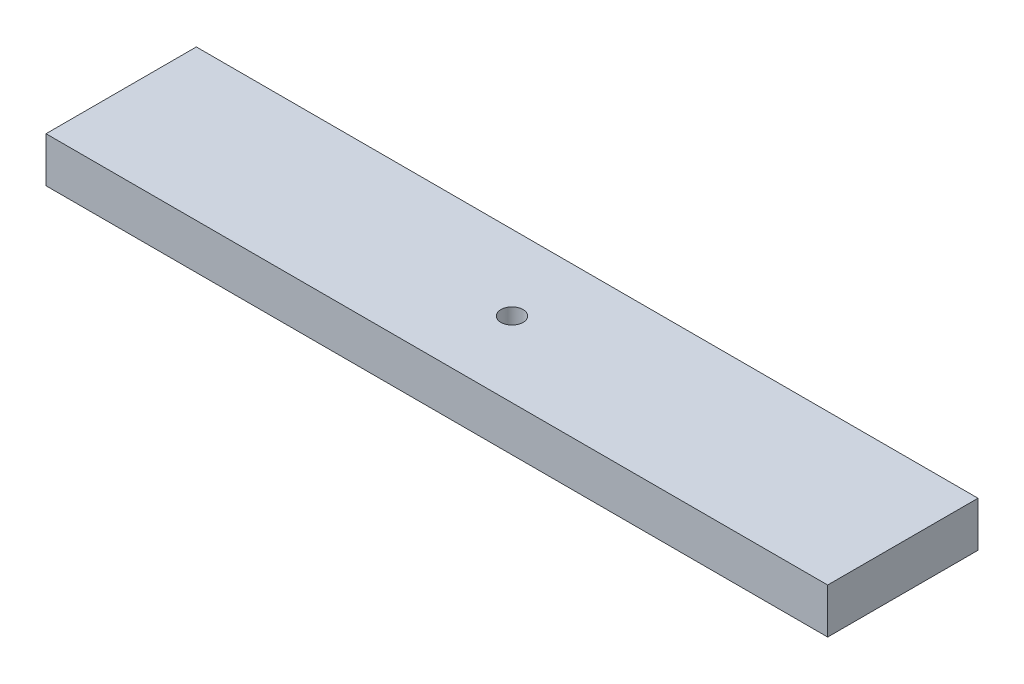
ISO-10303-21;
HEADER;
FILE_DESCRIPTION(('STEP AP214'),'2;1');
FILE_NAME('part.step','',(''),(''),'','','');
FILE_SCHEMA(('AUTOMOTIVE_DESIGN { 1 0 10303 214 1 1 1 1 }'));
ENDSEC;
DATA;
#1=APPLICATION_CONTEXT('core data for automotive mechanical design processes');
#2=APPLICATION_PROTOCOL_DEFINITION('international standard','automotive_design',2000,#1);
#3=PRODUCT_CONTEXT('',#1,'mechanical');
#4=PRODUCT('Part','Part','',(#3));
#5=PRODUCT_RELATED_PRODUCT_CATEGORY('part','',(#4));
#6=PRODUCT_DEFINITION_FORMATION('','',#4);
#7=PRODUCT_DEFINITION_CONTEXT('part definition',#1,'design');
#8=PRODUCT_DEFINITION('design','',#6,#7);
#9=PRODUCT_DEFINITION_SHAPE('','',#8);
#10=(LENGTH_UNIT() NAMED_UNIT(*) SI_UNIT(.MILLI.,.METRE.));
#11=(NAMED_UNIT(*) PLANE_ANGLE_UNIT() SI_UNIT($,.RADIAN.));
#12=(NAMED_UNIT(*) SI_UNIT($,.STERADIAN.) SOLID_ANGLE_UNIT());
#13=UNCERTAINTY_MEASURE_WITH_UNIT(LENGTH_MEASURE(1.E-05),#10,'distance_accuracy_value','');
#14=(GEOMETRIC_REPRESENTATION_CONTEXT(3) GLOBAL_UNCERTAINTY_ASSIGNED_CONTEXT((#13)) GLOBAL_UNIT_ASSIGNED_CONTEXT((#10,
#11,#12)) REPRESENTATION_CONTEXT('',''));
#15=CARTESIAN_POINT('',(0.,0.,0.));
#16=DIRECTION('',(0.,0.,1.));
#17=DIRECTION('',(1.,0.,0.));
#18=AXIS2_PLACEMENT_3D('',#15,#16,#17);
#19=CARTESIAN_POINT('',(-165.1,0.,63.5));
#20=DIRECTION('',(0.,1.,0.));
#21=DIRECTION('',(0.,0.,1.));
#22=AXIS2_PLACEMENT_3D('',#19,#20,#21);
#23=PLANE('',#22);
#24=DIRECTION('',(1.,0.,0.));
#25=VECTOR('',#24,1.);
#26=CARTESIAN_POINT('',(-165.1,0.,0.));
#27=LINE('',#26,#25);
#28=CARTESIAN_POINT('',(-165.1,0.,0.));
#29=VERTEX_POINT('',#28);
#30=CARTESIAN_POINT('',(165.1,0.,0.));
#31=VERTEX_POINT('',#30);
#32=EDGE_CURVE('E89',#29,#31,#27,.T.);
#33=ORIENTED_EDGE('',*,*,#32,.T.);
#34=DIRECTION('',(0.,0.,-1.));
#35=VECTOR('',#34,1.);
#36=CARTESIAN_POINT('',(165.1,0.,63.5));
#37=LINE('',#36,#35);
#38=CARTESIAN_POINT('',(165.1,0.,63.5));
#39=VERTEX_POINT('',#38);
#40=EDGE_CURVE('E42',#39,#31,#37,.T.);
#41=ORIENTED_EDGE('',*,*,#40,.F.);
#42=DIRECTION('',(1.,0.,0.));
#43=VECTOR('',#42,1.);
#44=CARTESIAN_POINT('',(-165.1,0.,63.5));
#45=LINE('',#44,#43);
#46=CARTESIAN_POINT('',(-165.1,0.,63.5));
#47=VERTEX_POINT('',#46);
#48=EDGE_CURVE('E80',#47,#39,#45,.T.);
#49=ORIENTED_EDGE('',*,*,#48,.F.);
#50=DIRECTION('',(0.,0.,-1.));
#51=VECTOR('',#50,1.);
#52=CARTESIAN_POINT('',(-165.1,0.,63.5));
#53=LINE('',#52,#51);
#54=EDGE_CURVE('E11',#47,#29,#53,.T.);
#55=ORIENTED_EDGE('',*,*,#54,.T.);
#56=EDGE_LOOP('',(#33,#41,#49,#55));
#57=FACE_BOUND('',#56,.T.);
#58=CARTESIAN_POINT('',(0.,0.,31.75));
#59=DIRECTION('',(0.,1.,0.));
#60=DIRECTION('',(0.,0.,1.));
#61=AXIS2_PLACEMENT_3D('',#58,#59,#60);
#62=CIRCLE('',#61,4.699);
#63=CARTESIAN_POINT('',(0.,0.,36.449));
#64=VERTEX_POINT('',#63);
#65=EDGE_CURVE('E112',#64,#64,#62,.T.);
#66=ORIENTED_EDGE('',*,*,#65,.T.);
#67=EDGE_LOOP('',(#66));
#68=FACE_BOUND('',#67,.T.);
#69=ADVANCED_FACE('F33',(#57,#68),#23,.F.);
#70=CARTESIAN_POINT('',(-165.1,19.05,63.5));
#71=DIRECTION('',(0.,-1.,0.));
#72=DIRECTION('',(0.,0.,-1.));
#73=AXIS2_PLACEMENT_3D('',#70,#71,#72);
#74=PLANE('',#73);
#75=DIRECTION('',(-1.,0.,0.));
#76=VECTOR('',#75,1.);
#77=CARTESIAN_POINT('',(-165.1,19.05,0.));
#78=LINE('',#77,#76);
#79=CARTESIAN_POINT('',(165.1,19.05,0.));
#80=VERTEX_POINT('',#79);
#81=CARTESIAN_POINT('',(-165.1,19.05,0.));
#82=VERTEX_POINT('',#81);
#83=EDGE_CURVE('E73',#80,#82,#78,.T.);
#84=ORIENTED_EDGE('',*,*,#83,.T.);
#85=DIRECTION('',(0.,0.,-1.));
#86=VECTOR('',#85,1.);
#87=CARTESIAN_POINT('',(-165.1,19.05,63.5));
#88=LINE('',#87,#86);
#89=CARTESIAN_POINT('',(-165.1,19.05,63.5));
#90=VERTEX_POINT('',#89);
#91=EDGE_CURVE('E93',#90,#82,#88,.T.);
#92=ORIENTED_EDGE('',*,*,#91,.F.);
#93=DIRECTION('',(-1.,0.,0.));
#94=VECTOR('',#93,1.);
#95=CARTESIAN_POINT('',(-165.1,19.05,63.5));
#96=LINE('',#95,#94);
#97=CARTESIAN_POINT('',(165.1,19.05,63.5));
#98=VERTEX_POINT('',#97);
#99=EDGE_CURVE('E50',#98,#90,#96,.T.);
#100=ORIENTED_EDGE('',*,*,#99,.F.);
#101=DIRECTION('',(0.,0.,-1.));
#102=VECTOR('',#101,1.);
#103=CARTESIAN_POINT('',(165.1,19.05,63.5));
#104=LINE('',#103,#102);
#105=EDGE_CURVE('E90',#98,#80,#104,.T.);
#106=ORIENTED_EDGE('',*,*,#105,.T.);
#107=EDGE_LOOP('',(#84,#92,#100,#106));
#108=FACE_BOUND('',#107,.T.);
#109=CARTESIAN_POINT('',(0.,19.05,31.75));
#110=DIRECTION('',(0.,1.,0.));
#111=DIRECTION('',(0.,0.,1.));
#112=AXIS2_PLACEMENT_3D('',#109,#110,#111);
#113=CIRCLE('',#112,4.699);
#114=CARTESIAN_POINT('',(0.,19.05,36.449));
#115=VERTEX_POINT('',#114);
#116=EDGE_CURVE('E100',#115,#115,#113,.T.);
#117=ORIENTED_EDGE('',*,*,#116,.F.);
#118=EDGE_LOOP('',(#117));
#119=FACE_BOUND('',#118,.T.);
#120=ADVANCED_FACE('F105',(#108,#119),#74,.F.);
#121=CARTESIAN_POINT('',(-165.1,0.,63.5));
#122=DIRECTION('',(1.,0.,0.));
#123=DIRECTION('',(0.,1.,0.));
#124=AXIS2_PLACEMENT_3D('',#121,#122,#123);
#125=PLANE('',#124);
#126=DIRECTION('',(0.,-1.,0.));
#127=VECTOR('',#126,1.);
#128=CARTESIAN_POINT('',(-165.1,0.,0.));
#129=LINE('',#128,#127);
#130=EDGE_CURVE('E97',#82,#29,#129,.T.);
#131=ORIENTED_EDGE('',*,*,#130,.T.);
#132=ORIENTED_EDGE('',*,*,#54,.F.);
#133=DIRECTION('',(0.,-1.,0.));
#134=VECTOR('',#133,1.);
#135=CARTESIAN_POINT('',(-165.1,0.,63.5));
#136=LINE('',#135,#134);
#137=EDGE_CURVE('E85',#90,#47,#136,.T.);
#138=ORIENTED_EDGE('',*,*,#137,.F.);
#139=ORIENTED_EDGE('',*,*,#91,.T.);
#140=EDGE_LOOP('',(#131,#132,#138,#139));
#141=FACE_BOUND('',#140,.T.);
#142=ADVANCED_FACE('F35',(#141),#125,.F.);
#143=CARTESIAN_POINT('',(165.1,0.,63.5));
#144=DIRECTION('',(-1.,0.,0.));
#145=DIRECTION('',(0.,-1.,0.));
#146=AXIS2_PLACEMENT_3D('',#143,#144,#145);
#147=PLANE('',#146);
#148=DIRECTION('',(0.,1.,0.));
#149=VECTOR('',#148,1.);
#150=CARTESIAN_POINT('',(165.1,0.,0.));
#151=LINE('',#150,#149);
#152=EDGE_CURVE('E67',#31,#80,#151,.T.);
#153=ORIENTED_EDGE('',*,*,#152,.T.);
#154=ORIENTED_EDGE('',*,*,#105,.F.);
#155=DIRECTION('',(0.,1.,0.));
#156=VECTOR('',#155,1.);
#157=CARTESIAN_POINT('',(165.1,0.,63.5));
#158=LINE('',#157,#156);
#159=EDGE_CURVE('E83',#39,#98,#158,.T.);
#160=ORIENTED_EDGE('',*,*,#159,.F.);
#161=ORIENTED_EDGE('',*,*,#40,.T.);
#162=EDGE_LOOP('',(#153,#154,#160,#161));
#163=FACE_BOUND('',#162,.T.);
#164=ADVANCED_FACE('F91',(#163),#147,.F.);
#165=CARTESIAN_POINT('',(0.,0.,63.5));
#166=DIRECTION('',(0.,0.,-1.));
#167=DIRECTION('',(-1.,0.,0.));
#168=AXIS2_PLACEMENT_3D('',#165,#166,#167);
#169=PLANE('',#168);
#170=ORIENTED_EDGE('',*,*,#137,.T.);
#171=ORIENTED_EDGE('',*,*,#48,.T.);
#172=ORIENTED_EDGE('',*,*,#159,.T.);
#173=ORIENTED_EDGE('',*,*,#99,.T.);
#174=EDGE_LOOP('',(#170,#171,#172,#173));
#175=FACE_BOUND('',#174,.T.);
#176=ADVANCED_FACE('F81',(#175),#169,.F.);
#177=CARTESIAN_POINT('',(0.,0.,0.));
#178=DIRECTION('',(0.,0.,-1.));
#179=DIRECTION('',(-1.,0.,0.));
#180=AXIS2_PLACEMENT_3D('',#177,#178,#179);
#181=PLANE('',#180);
#182=ORIENTED_EDGE('',*,*,#130,.F.);
#183=ORIENTED_EDGE('',*,*,#83,.F.);
#184=ORIENTED_EDGE('',*,*,#152,.F.);
#185=ORIENTED_EDGE('',*,*,#32,.F.);
#186=EDGE_LOOP('',(#182,#183,#184,#185));
#187=FACE_BOUND('',#186,.T.);
#188=ADVANCED_FACE('F109',(#187),#181,.T.);
#189=CARTESIAN_POINT('',(0.,19.05,31.75));
#190=DIRECTION('',(0.,-1.,0.));
#191=DIRECTION('',(0.,0.,-1.));
#192=AXIS2_PLACEMENT_3D('',#189,#190,#191);
#193=CYLINDRICAL_SURFACE('',#192,4.699);
#194=ORIENTED_EDGE('',*,*,#116,.T.);
#195=EDGE_LOOP('',(#194));
#196=FACE_BOUND('',#195,.T.);
#197=ORIENTED_EDGE('',*,*,#65,.F.);
#198=EDGE_LOOP('',(#197));
#199=FACE_BOUND('',#198,.T.);
#200=ADVANCED_FACE('F118',(#196,#199),#193,.F.);
#201=CLOSED_SHELL('',(#69,#120,#142,#164,#176,#188,#200));
#202=MANIFOLD_SOLID_BREP('B2',#201);
#203=ADVANCED_BREP_SHAPE_REPRESENTATION('',(#18,#202),#14);
#204=SHAPE_DEFINITION_REPRESENTATION(#9,#203);
ENDSEC;
END-ISO-10303-21;
